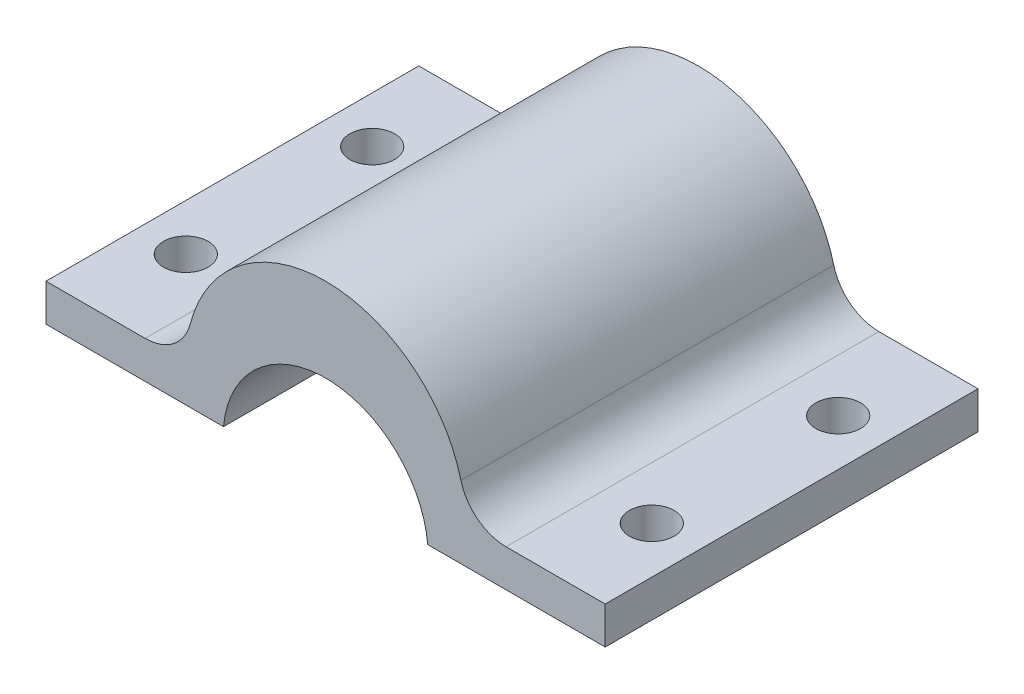
ISO-10303-21;
HEADER;
FILE_DESCRIPTION(('STEP AP214'),'2;1');
FILE_NAME('part.step','',(''),(''),'','','');
FILE_SCHEMA(('AUTOMOTIVE_DESIGN { 1 0 10303 214 1 1 1 1 }'));
ENDSEC;
DATA;
#1=APPLICATION_CONTEXT('core data for automotive mechanical design processes');
#2=APPLICATION_PROTOCOL_DEFINITION('international standard','automotive_design',2000,#1);
#3=PRODUCT_CONTEXT('',#1,'mechanical');
#4=PRODUCT('Part','Part','',(#3));
#5=PRODUCT_RELATED_PRODUCT_CATEGORY('part','',(#4));
#6=PRODUCT_DEFINITION_FORMATION('','',#4);
#7=PRODUCT_DEFINITION_CONTEXT('part definition',#1,'design');
#8=PRODUCT_DEFINITION('design','',#6,#7);
#9=PRODUCT_DEFINITION_SHAPE('','',#8);
#10=(LENGTH_UNIT() NAMED_UNIT(*) SI_UNIT(.MILLI.,.METRE.));
#11=(NAMED_UNIT(*) PLANE_ANGLE_UNIT() SI_UNIT($,.RADIAN.));
#12=(NAMED_UNIT(*) SI_UNIT($,.STERADIAN.) SOLID_ANGLE_UNIT());
#13=UNCERTAINTY_MEASURE_WITH_UNIT(LENGTH_MEASURE(1.E-05),#10,'distance_accuracy_value','');
#14=(GEOMETRIC_REPRESENTATION_CONTEXT(3) GLOBAL_UNCERTAINTY_ASSIGNED_CONTEXT((#13)) GLOBAL_UNIT_ASSIGNED_CONTEXT((#10,
#11,#12)) REPRESENTATION_CONTEXT('',''));
#15=CARTESIAN_POINT('',(0.,0.,0.));
#16=DIRECTION('',(0.,0.,1.));
#17=DIRECTION('',(1.,0.,0.));
#18=AXIS2_PLACEMENT_3D('',#15,#16,#17);
#19=CARTESIAN_POINT('',(30.,0.,40.));
#20=DIRECTION('',(0.,0.,-1.));
#21=DIRECTION('',(-1.,0.,0.));
#22=AXIS2_PLACEMENT_3D('',#19,#20,#21);
#23=CYLINDRICAL_SURFACE('',#22,11.);
#24=CARTESIAN_POINT('',(30.,0.,40.));
#25=DIRECTION('',(0.,0.,-1.));
#26=DIRECTION('',(-1.,0.,0.));
#27=AXIS2_PLACEMENT_3D('',#24,#25,#26);
#28=CIRCLE('',#27,11.);
#29=CARTESIAN_POINT('',(19.0455488498967,1.,40.));
#30=VERTEX_POINT('',#29);
#31=CARTESIAN_POINT('',(40.9544511501033,1.,40.));
#32=VERTEX_POINT('',#31);
#33=EDGE_CURVE('E172',#30,#32,#28,.T.);
#34=ORIENTED_EDGE('',*,*,#33,.F.);
#35=DIRECTION('',(0.,0.,-1.));
#36=VECTOR('',#35,1.);
#37=CARTESIAN_POINT('',(19.0455488498967,1.,40.));
#38=LINE('',#37,#36);
#39=CARTESIAN_POINT('',(19.0455488498967,1.,0.));
#40=VERTEX_POINT('',#39);
#41=EDGE_CURVE('E118',#40,#30,#38,.F.);
#42=ORIENTED_EDGE('',*,*,#41,.F.);
#43=CARTESIAN_POINT('',(30.,0.,0.));
#44=DIRECTION('',(0.,0.,-1.));
#45=DIRECTION('',(-1.,0.,0.));
#46=AXIS2_PLACEMENT_3D('',#43,#44,#45);
#47=CIRCLE('',#46,11.);
#48=CARTESIAN_POINT('',(40.9544511501033,0.999999999999999,0.));
#49=VERTEX_POINT('',#48);
#50=EDGE_CURVE('E152',#40,#49,#47,.T.);
#51=ORIENTED_EDGE('',*,*,#50,.T.);
#52=DIRECTION('',(0.,0.,-1.));
#53=VECTOR('',#52,1.);
#54=CARTESIAN_POINT('',(40.9544511501033,1.,40.));
#55=LINE('',#54,#53);
#56=EDGE_CURVE('E55',#32,#49,#55,.T.);
#57=ORIENTED_EDGE('',*,*,#56,.F.);
#58=EDGE_LOOP('',(#34,#42,#51,#57));
#59=FACE_BOUND('',#58,.T.);
#60=ADVANCED_FACE('F39',(#59),#23,.F.);
#61=CARTESIAN_POINT('',(60.,0.,40.));
#62=DIRECTION('',(-1.,0.,0.));
#63=DIRECTION('',(0.,0.,1.));
#64=AXIS2_PLACEMENT_3D('',#61,#62,#63);
#65=PLANE('',#64);
#66=DIRECTION('',(0.,1.,0.));
#67=VECTOR('',#66,1.);
#68=CARTESIAN_POINT('',(60.,0.,40.));
#69=LINE('',#68,#67);
#70=CARTESIAN_POINT('',(60.,1.,40.));
#71=VERTEX_POINT('',#70);
#72=CARTESIAN_POINT('',(60.,5.,40.));
#73=VERTEX_POINT('',#72);
#74=EDGE_CURVE('E221',#71,#73,#69,.T.);
#75=ORIENTED_EDGE('',*,*,#74,.F.);
#76=DIRECTION('',(0.,0.,-1.));
#77=VECTOR('',#76,1.);
#78=CARTESIAN_POINT('',(60.,1.,40.001));
#79=LINE('',#78,#77);
#80=CARTESIAN_POINT('',(60.,1.,0.));
#81=VERTEX_POINT('',#80);
#82=EDGE_CURVE('E248',#71,#81,#79,.T.);
#83=ORIENTED_EDGE('',*,*,#82,.T.);
#84=DIRECTION('',(0.,1.,0.));
#85=VECTOR('',#84,1.);
#86=CARTESIAN_POINT('',(60.,0.,0.));
#87=LINE('',#86,#85);
#88=CARTESIAN_POINT('',(60.,5.,0.));
#89=VERTEX_POINT('',#88);
#90=EDGE_CURVE('E156',#81,#89,#87,.T.);
#91=ORIENTED_EDGE('',*,*,#90,.T.);
#92=DIRECTION('',(0.,0.,-1.));
#93=VECTOR('',#92,1.);
#94=CARTESIAN_POINT('',(60.,5.,40.));
#95=LINE('',#94,#93);
#96=EDGE_CURVE('E146',#73,#89,#95,.T.);
#97=ORIENTED_EDGE('',*,*,#96,.F.);
#98=EDGE_LOOP('',(#75,#83,#91,#97));
#99=FACE_BOUND('',#98,.T.);
#100=ADVANCED_FACE('F298',(#99),#65,.F.);
#101=CARTESIAN_POINT('',(45.,5.,40.));
#102=DIRECTION('',(0.,-1.,0.));
#103=DIRECTION('',(0.,0.,-1.));
#104=AXIS2_PLACEMENT_3D('',#101,#102,#103);
#105=PLANE('',#104);
#106=CARTESIAN_POINT('',(55.,5.,30.));
#107=DIRECTION('',(0.,1.,0.));
#108=DIRECTION('',(0.,0.,1.));
#109=AXIS2_PLACEMENT_3D('',#106,#107,#108);
#110=CIRCLE('',#109,2.4);
#111=CARTESIAN_POINT('',(55.,5.,32.4));
#112=VERTEX_POINT('',#111);
#113=EDGE_CURVE('E236',#112,#112,#110,.T.);
#114=ORIENTED_EDGE('',*,*,#113,.F.);
#115=EDGE_LOOP('',(#114));
#116=FACE_BOUND('',#115,.T.);
#117=CARTESIAN_POINT('',(55.,5.,10.));
#118=DIRECTION('',(0.,1.,0.));
#119=DIRECTION('',(0.,0.,1.));
#120=AXIS2_PLACEMENT_3D('',#117,#118,#119);
#121=CIRCLE('',#120,2.4);
#122=CARTESIAN_POINT('',(55.,5.,12.4));
#123=VERTEX_POINT('',#122);
#124=EDGE_CURVE('E231',#123,#123,#121,.T.);
#125=ORIENTED_EDGE('',*,*,#124,.F.);
#126=EDGE_LOOP('',(#125));
#127=FACE_BOUND('',#126,.T.);
#128=DIRECTION('',(-1.,0.,0.));
#129=VECTOR('',#128,1.);
#130=CARTESIAN_POINT('',(45.,5.,0.));
#131=LINE('',#130,#129);
#132=CARTESIAN_POINT('',(49.3649167310371,5.,0.));
#133=VERTEX_POINT('',#132);
#134=EDGE_CURVE('E160',#89,#133,#131,.T.);
#135=ORIENTED_EDGE('',*,*,#134,.T.);
#136=DIRECTION('',(0.,0.,1.));
#137=VECTOR('',#136,1.);
#138=CARTESIAN_POINT('',(49.3649167310371,5.,40.));
#139=LINE('',#138,#137);
#140=CARTESIAN_POINT('',(49.3649167310371,5.,40.));
#141=VERTEX_POINT('',#140);
#142=EDGE_CURVE('E188',#133,#141,#139,.T.);
#143=ORIENTED_EDGE('',*,*,#142,.T.);
#144=DIRECTION('',(-1.,0.,0.));
#145=VECTOR('',#144,1.);
#146=CARTESIAN_POINT('',(45.,5.,40.));
#147=LINE('',#146,#145);
#148=EDGE_CURVE('E215',#73,#141,#147,.T.);
#149=ORIENTED_EDGE('',*,*,#148,.F.);
#150=ORIENTED_EDGE('',*,*,#96,.T.);
#151=EDGE_LOOP('',(#135,#143,#149,#150));
#152=FACE_BOUND('',#151,.T.);
#153=ADVANCED_FACE('F207',(#116,#127,#152),#105,.F.);
#154=CARTESIAN_POINT('',(30.,5.,40.));
#155=DIRECTION('',(0.,0.,-1.));
#156=DIRECTION('',(-1.,0.,0.));
#157=AXIS2_PLACEMENT_3D('',#154,#155,#156);
#158=CYLINDRICAL_SURFACE('',#157,15.);
#159=CARTESIAN_POINT('',(30.,5.,0.));
#160=DIRECTION('',(0.,0.,1.));
#161=DIRECTION('',(1.,0.,0.));
#162=AXIS2_PLACEMENT_3D('',#159,#160,#161);
#163=CIRCLE('',#162,15.);
#164=CARTESIAN_POINT('',(44.5236875482778,8.75,0.));
#165=VERTEX_POINT('',#164);
#166=CARTESIAN_POINT('',(15.4763124517222,8.75,0.));
#167=VERTEX_POINT('',#166);
#168=EDGE_CURVE('E164',#165,#167,#163,.T.);
#169=ORIENTED_EDGE('',*,*,#168,.T.);
#170=DIRECTION('',(0.,0.,-1.));
#171=VECTOR('',#170,1.);
#172=CARTESIAN_POINT('',(15.4763124517222,8.75,40.));
#173=LINE('',#172,#171);
#174=CARTESIAN_POINT('',(15.4763124517222,8.75,40.));
#175=VERTEX_POINT('',#174);
#176=EDGE_CURVE('E185',#167,#175,#173,.F.);
#177=ORIENTED_EDGE('',*,*,#176,.T.);
#178=CARTESIAN_POINT('',(30.,5.,40.));
#179=DIRECTION('',(0.,0.,1.));
#180=DIRECTION('',(1.,0.,0.));
#181=AXIS2_PLACEMENT_3D('',#178,#179,#180);
#182=CIRCLE('',#181,15.);
#183=CARTESIAN_POINT('',(44.5236875482778,8.75,40.));
#184=VERTEX_POINT('',#183);
#185=EDGE_CURVE('E148',#184,#175,#182,.T.);
#186=ORIENTED_EDGE('',*,*,#185,.F.);
#187=DIRECTION('',(0.,0.,-1.));
#188=VECTOR('',#187,1.);
#189=CARTESIAN_POINT('',(44.5236875482778,8.75,40.));
#190=LINE('',#189,#188);
#191=EDGE_CURVE('E181',#184,#165,#190,.T.);
#192=ORIENTED_EDGE('',*,*,#191,.T.);
#193=EDGE_LOOP('',(#169,#177,#186,#192));
#194=FACE_BOUND('',#193,.T.);
#195=ADVANCED_FACE('F217',(#194),#158,.T.);
#196=CARTESIAN_POINT('',(0.,5.,40.));
#197=DIRECTION('',(0.,-1.,0.));
#198=DIRECTION('',(0.,0.,-1.));
#199=AXIS2_PLACEMENT_3D('',#196,#197,#198);
#200=PLANE('',#199);
#201=CARTESIAN_POINT('',(5.,5.,30.));
#202=DIRECTION('',(0.,1.,0.));
#203=DIRECTION('',(0.,0.,1.));
#204=AXIS2_PLACEMENT_3D('',#201,#202,#203);
#205=CIRCLE('',#204,2.4);
#206=CARTESIAN_POINT('',(5.,5.,32.4));
#207=VERTEX_POINT('',#206);
#208=EDGE_CURVE('E232',#207,#207,#205,.T.);
#209=ORIENTED_EDGE('',*,*,#208,.F.);
#210=EDGE_LOOP('',(#209));
#211=FACE_BOUND('',#210,.T.);
#212=CARTESIAN_POINT('',(5.,5.,10.));
#213=DIRECTION('',(0.,1.,0.));
#214=DIRECTION('',(0.,0.,1.));
#215=AXIS2_PLACEMENT_3D('',#212,#213,#214);
#216=CIRCLE('',#215,2.4);
#217=CARTESIAN_POINT('',(5.,5.,12.4));
#218=VERTEX_POINT('',#217);
#219=EDGE_CURVE('E157',#218,#218,#216,.T.);
#220=ORIENTED_EDGE('',*,*,#219,.F.);
#221=EDGE_LOOP('',(#220));
#222=FACE_BOUND('',#221,.T.);
#223=DIRECTION('',(-1.,0.,0.));
#224=VECTOR('',#223,1.);
#225=CARTESIAN_POINT('',(0.,5.,40.));
#226=LINE('',#225,#224);
#227=CARTESIAN_POINT('',(10.6350832689629,5.,40.));
#228=VERTEX_POINT('',#227);
#229=CARTESIAN_POINT('',(0.,5.,40.));
#230=VERTEX_POINT('',#229);
#231=EDGE_CURVE('E139',#228,#230,#226,.T.);
#232=ORIENTED_EDGE('',*,*,#231,.F.);
#233=DIRECTION('',(0.,0.,1.));
#234=VECTOR('',#233,1.);
#235=CARTESIAN_POINT('',(10.6350832689629,5.,0.));
#236=LINE('',#235,#234);
#237=CARTESIAN_POINT('',(10.6350832689629,5.,0.));
#238=VERTEX_POINT('',#237);
#239=EDGE_CURVE('E177',#228,#238,#236,.F.);
#240=ORIENTED_EDGE('',*,*,#239,.T.);
#241=DIRECTION('',(-1.,0.,0.));
#242=VECTOR('',#241,1.);
#243=CARTESIAN_POINT('',(0.,5.,0.));
#244=LINE('',#243,#242);
#245=CARTESIAN_POINT('',(0.,5.,0.));
#246=VERTEX_POINT('',#245);
#247=EDGE_CURVE('E168',#238,#246,#244,.T.);
#248=ORIENTED_EDGE('',*,*,#247,.T.);
#249=DIRECTION('',(0.,0.,-1.));
#250=VECTOR('',#249,1.);
#251=CARTESIAN_POINT('',(0.,5.,40.));
#252=LINE('',#251,#250);
#253=EDGE_CURVE('E142',#230,#246,#252,.T.);
#254=ORIENTED_EDGE('',*,*,#253,.F.);
#255=EDGE_LOOP('',(#232,#240,#248,#254));
#256=FACE_BOUND('',#255,.T.);
#257=ADVANCED_FACE('F285',(#211,#222,#256),#200,.F.);
#258=CARTESIAN_POINT('',(0.,0.,40.));
#259=DIRECTION('',(1.,0.,0.));
#260=DIRECTION('',(0.,0.,-1.));
#261=AXIS2_PLACEMENT_3D('',#258,#259,#260);
#262=PLANE('',#261);
#263=DIRECTION('',(0.,-1.,0.));
#264=VECTOR('',#263,1.);
#265=CARTESIAN_POINT('',(0.,0.,0.));
#266=LINE('',#265,#264);
#267=CARTESIAN_POINT('',(0.,1.,0.));
#268=VERTEX_POINT('',#267);
#269=EDGE_CURVE('E133',#246,#268,#266,.T.);
#270=ORIENTED_EDGE('',*,*,#269,.T.);
#271=DIRECTION('',(0.,0.,-1.));
#272=VECTOR('',#271,1.);
#273=CARTESIAN_POINT('',(0.,1.,40.001));
#274=LINE('',#273,#272);
#275=CARTESIAN_POINT('',(0.,1.,40.));
#276=VERTEX_POINT('',#275);
#277=EDGE_CURVE('E63',#276,#268,#274,.T.);
#278=ORIENTED_EDGE('',*,*,#277,.F.);
#279=DIRECTION('',(0.,-1.,0.));
#280=VECTOR('',#279,1.);
#281=CARTESIAN_POINT('',(0.,0.,40.));
#282=LINE('',#281,#280);
#283=EDGE_CURVE('E131',#230,#276,#282,.T.);
#284=ORIENTED_EDGE('',*,*,#283,.F.);
#285=ORIENTED_EDGE('',*,*,#253,.T.);
#286=EDGE_LOOP('',(#270,#278,#284,#285));
#287=FACE_BOUND('',#286,.T.);
#288=ADVANCED_FACE('F129',(#287),#262,.F.);
#289=CARTESIAN_POINT('',(30.,5.,40.));
#290=DIRECTION('',(0.,0.,1.));
#291=DIRECTION('',(1.,0.,0.));
#292=AXIS2_PLACEMENT_3D('',#289,#290,#291);
#293=PLANE('',#292);
#294=DIRECTION('',(1.,0.,0.));
#295=VECTOR('',#294,1.);
#296=CARTESIAN_POINT('',(60.,1.,40.));
#297=LINE('',#296,#295);
#298=EDGE_CURVE('E114',#276,#30,#297,.T.);
#299=ORIENTED_EDGE('',*,*,#298,.T.);
#300=ORIENTED_EDGE('',*,*,#33,.T.);
#301=DIRECTION('',(1.,0.,0.));
#302=VECTOR('',#301,1.);
#303=CARTESIAN_POINT('',(60.,1.,40.));
#304=LINE('',#303,#302);
#305=EDGE_CURVE('E244',#32,#71,#304,.T.);
#306=ORIENTED_EDGE('',*,*,#305,.T.);
#307=ORIENTED_EDGE('',*,*,#74,.T.);
#308=ORIENTED_EDGE('',*,*,#148,.T.);
#309=CARTESIAN_POINT('',(49.3649167310371,10.,40.));
#310=DIRECTION('',(0.,0.,1.));
#311=DIRECTION('',(1.,0.,0.));
#312=AXIS2_PLACEMENT_3D('',#309,#310,#311);
#313=CIRCLE('',#312,5.);
#314=EDGE_CURVE('E11',#141,#184,#313,.F.);
#315=ORIENTED_EDGE('',*,*,#314,.T.);
#316=ORIENTED_EDGE('',*,*,#185,.T.);
#317=CARTESIAN_POINT('',(10.6350832689629,10.,40.));
#318=DIRECTION('',(0.,0.,1.));
#319=DIRECTION('',(1.,0.,0.));
#320=AXIS2_PLACEMENT_3D('',#317,#318,#319);
#321=CIRCLE('',#320,5.);
#322=EDGE_CURVE('E194',#175,#228,#321,.F.);
#323=ORIENTED_EDGE('',*,*,#322,.T.);
#324=ORIENTED_EDGE('',*,*,#231,.T.);
#325=ORIENTED_EDGE('',*,*,#283,.T.);
#326=EDGE_LOOP('',(#299,#300,#306,#307,#308,#315,#316,#323,#324,#325));
#327=FACE_BOUND('',#326,.T.);
#328=ADVANCED_FACE('F137',(#327),#293,.T.);
#329=CARTESIAN_POINT('',(30.,5.,0.));
#330=DIRECTION('',(0.,0.,1.));
#331=DIRECTION('',(1.,0.,0.));
#332=AXIS2_PLACEMENT_3D('',#329,#330,#331);
#333=PLANE('',#332);
#334=ORIENTED_EDGE('',*,*,#50,.F.);
#335=DIRECTION('',(1.,0.,0.));
#336=VECTOR('',#335,1.);
#337=CARTESIAN_POINT('',(60.,1.,0.));
#338=LINE('',#337,#336);
#339=EDGE_CURVE('E124',#268,#40,#338,.T.);
#340=ORIENTED_EDGE('',*,*,#339,.F.);
#341=ORIENTED_EDGE('',*,*,#269,.F.);
#342=ORIENTED_EDGE('',*,*,#247,.F.);
#343=CARTESIAN_POINT('',(10.6350832689629,10.,0.));
#344=DIRECTION('',(0.,0.,1.));
#345=DIRECTION('',(1.,0.,0.));
#346=AXIS2_PLACEMENT_3D('',#343,#344,#345);
#347=CIRCLE('',#346,5.);
#348=EDGE_CURVE('E191',#238,#167,#347,.T.);
#349=ORIENTED_EDGE('',*,*,#348,.T.);
#350=ORIENTED_EDGE('',*,*,#168,.F.);
#351=CARTESIAN_POINT('',(49.3649167310371,10.,0.));
#352=DIRECTION('',(0.,0.,1.));
#353=DIRECTION('',(1.,0.,0.));
#354=AXIS2_PLACEMENT_3D('',#351,#352,#353);
#355=CIRCLE('',#354,5.);
#356=EDGE_CURVE('E48',#165,#133,#355,.T.);
#357=ORIENTED_EDGE('',*,*,#356,.T.);
#358=ORIENTED_EDGE('',*,*,#134,.F.);
#359=ORIENTED_EDGE('',*,*,#90,.F.);
#360=DIRECTION('',(1.,0.,0.));
#361=VECTOR('',#360,1.);
#362=CARTESIAN_POINT('',(60.,1.,0.));
#363=LINE('',#362,#361);
#364=EDGE_CURVE('E249',#49,#81,#363,.T.);
#365=ORIENTED_EDGE('',*,*,#364,.F.);
#366=EDGE_LOOP('',(#334,#340,#341,#342,#349,#350,#357,#358,#359,#365));
#367=FACE_BOUND('',#366,.T.);
#368=ADVANCED_FACE('F201',(#367),#333,.F.);
#369=CARTESIAN_POINT('',(5.,0.,10.));
#370=DIRECTION('',(0.,1.,0.));
#371=DIRECTION('',(0.,0.,1.));
#372=AXIS2_PLACEMENT_3D('',#369,#370,#371);
#373=CYLINDRICAL_SURFACE('',#372,2.4);
#374=CARTESIAN_POINT('',(5.,1.,10.));
#375=DIRECTION('',(0.,1.,0.));
#376=DIRECTION('',(0.,0.,1.));
#377=AXIS2_PLACEMENT_3D('',#374,#375,#376);
#378=CIRCLE('',#377,2.4);
#379=CARTESIAN_POINT('',(5.,1.,12.4));
#380=VERTEX_POINT('',#379);
#381=EDGE_CURVE('E237',#380,#380,#378,.T.);
#382=ORIENTED_EDGE('',*,*,#381,.F.);
#383=EDGE_LOOP('',(#382));
#384=FACE_BOUND('',#383,.T.);
#385=ORIENTED_EDGE('',*,*,#219,.T.);
#386=EDGE_LOOP('',(#385));
#387=FACE_BOUND('',#386,.T.);
#388=ADVANCED_FACE('F281',(#384,#387),#373,.F.);
#389=CARTESIAN_POINT('',(5.,0.,30.));
#390=DIRECTION('',(0.,1.,0.));
#391=DIRECTION('',(0.,0.,1.));
#392=AXIS2_PLACEMENT_3D('',#389,#390,#391);
#393=CYLINDRICAL_SURFACE('',#392,2.4);
#394=CARTESIAN_POINT('',(5.,1.,30.));
#395=DIRECTION('',(0.,1.,0.));
#396=DIRECTION('',(0.,0.,1.));
#397=AXIS2_PLACEMENT_3D('',#394,#395,#396);
#398=CIRCLE('',#397,2.4);
#399=CARTESIAN_POINT('',(5.,1.,32.4));
#400=VERTEX_POINT('',#399);
#401=EDGE_CURVE('E135',#400,#400,#398,.T.);
#402=ORIENTED_EDGE('',*,*,#401,.F.);
#403=EDGE_LOOP('',(#402));
#404=FACE_BOUND('',#403,.T.);
#405=ORIENTED_EDGE('',*,*,#208,.T.);
#406=EDGE_LOOP('',(#405));
#407=FACE_BOUND('',#406,.T.);
#408=ADVANCED_FACE('F277',(#404,#407),#393,.F.);
#409=CARTESIAN_POINT('',(55.,0.,10.));
#410=DIRECTION('',(0.,1.,0.));
#411=DIRECTION('',(0.,0.,1.));
#412=AXIS2_PLACEMENT_3D('',#409,#410,#411);
#413=CYLINDRICAL_SURFACE('',#412,2.4);
#414=CARTESIAN_POINT('',(55.,1.,10.));
#415=DIRECTION('',(0.,1.,0.));
#416=DIRECTION('',(0.,0.,1.));
#417=AXIS2_PLACEMENT_3D('',#414,#415,#416);
#418=CIRCLE('',#417,2.4);
#419=CARTESIAN_POINT('',(55.,1.,12.4));
#420=VERTEX_POINT('',#419);
#421=EDGE_CURVE('E258',#420,#420,#418,.T.);
#422=ORIENTED_EDGE('',*,*,#421,.F.);
#423=EDGE_LOOP('',(#422));
#424=FACE_BOUND('',#423,.T.);
#425=ORIENTED_EDGE('',*,*,#124,.T.);
#426=EDGE_LOOP('',(#425));
#427=FACE_BOUND('',#426,.T.);
#428=ADVANCED_FACE('F280',(#424,#427),#413,.F.);
#429=CARTESIAN_POINT('',(55.,0.,30.));
#430=DIRECTION('',(0.,1.,0.));
#431=DIRECTION('',(0.,0.,1.));
#432=AXIS2_PLACEMENT_3D('',#429,#430,#431);
#433=CYLINDRICAL_SURFACE('',#432,2.4);
#434=CARTESIAN_POINT('',(55.,1.,30.));
#435=DIRECTION('',(0.,1.,0.));
#436=DIRECTION('',(0.,0.,1.));
#437=AXIS2_PLACEMENT_3D('',#434,#435,#436);
#438=CIRCLE('',#437,2.4);
#439=CARTESIAN_POINT('',(55.,1.,32.4));
#440=VERTEX_POINT('',#439);
#441=EDGE_CURVE('E254',#440,#440,#438,.T.);
#442=ORIENTED_EDGE('',*,*,#441,.F.);
#443=EDGE_LOOP('',(#442));
#444=FACE_BOUND('',#443,.T.);
#445=ORIENTED_EDGE('',*,*,#113,.T.);
#446=EDGE_LOOP('',(#445));
#447=FACE_BOUND('',#446,.T.);
#448=ADVANCED_FACE('F307',(#444,#447),#433,.F.);
#449=CARTESIAN_POINT('',(10.6350832689629,10.,40.));
#450=DIRECTION('',(0.,0.,-1.));
#451=DIRECTION('',(-1.,0.,0.));
#452=AXIS2_PLACEMENT_3D('',#449,#450,#451);
#453=CYLINDRICAL_SURFACE('',#452,5.);
#454=ORIENTED_EDGE('',*,*,#322,.F.);
#455=ORIENTED_EDGE('',*,*,#176,.F.);
#456=ORIENTED_EDGE('',*,*,#348,.F.);
#457=ORIENTED_EDGE('',*,*,#239,.F.);
#458=EDGE_LOOP('',(#454,#455,#456,#457));
#459=FACE_BOUND('',#458,.T.);
#460=ADVANCED_FACE('F294',(#459),#453,.F.);
#461=CARTESIAN_POINT('',(49.3649167310371,10.,40.));
#462=DIRECTION('',(0.,0.,-1.));
#463=DIRECTION('',(-1.,0.,0.));
#464=AXIS2_PLACEMENT_3D('',#461,#462,#463);
#465=CYLINDRICAL_SURFACE('',#464,5.);
#466=ORIENTED_EDGE('',*,*,#314,.F.);
#467=ORIENTED_EDGE('',*,*,#142,.F.);
#468=ORIENTED_EDGE('',*,*,#356,.F.);
#469=ORIENTED_EDGE('',*,*,#191,.F.);
#470=EDGE_LOOP('',(#466,#467,#468,#469));
#471=FACE_BOUND('',#470,.T.);
#472=ADVANCED_FACE('F41',(#471),#465,.F.);
#473=CARTESIAN_POINT('',(60.,1.,40.001));
#474=DIRECTION('',(0.,1.,0.));
#475=DIRECTION('',(0.,0.,1.));
#476=AXIS2_PLACEMENT_3D('',#473,#474,#475);
#477=PLANE('',#476);
#478=ORIENTED_EDGE('',*,*,#56,.T.);
#479=ORIENTED_EDGE('',*,*,#364,.T.);
#480=ORIENTED_EDGE('',*,*,#82,.F.);
#481=ORIENTED_EDGE('',*,*,#305,.F.);
#482=EDGE_LOOP('',(#478,#479,#480,#481));
#483=FACE_BOUND('',#482,.T.);
#484=ORIENTED_EDGE('',*,*,#421,.T.);
#485=EDGE_LOOP('',(#484));
#486=FACE_BOUND('',#485,.T.);
#487=ORIENTED_EDGE('',*,*,#441,.T.);
#488=EDGE_LOOP('',(#487));
#489=FACE_BOUND('',#488,.T.);
#490=ADVANCED_FACE('F299',(#483,#486,#489),#477,.F.);
#491=CARTESIAN_POINT('',(60.,1.,40.001));
#492=DIRECTION('',(0.,1.,0.));
#493=DIRECTION('',(0.,0.,1.));
#494=AXIS2_PLACEMENT_3D('',#491,#492,#493);
#495=PLANE('',#494);
#496=ORIENTED_EDGE('',*,*,#41,.T.);
#497=ORIENTED_EDGE('',*,*,#298,.F.);
#498=ORIENTED_EDGE('',*,*,#277,.T.);
#499=ORIENTED_EDGE('',*,*,#339,.T.);
#500=EDGE_LOOP('',(#496,#497,#498,#499));
#501=FACE_BOUND('',#500,.T.);
#502=ORIENTED_EDGE('',*,*,#401,.T.);
#503=EDGE_LOOP('',(#502));
#504=FACE_BOUND('',#503,.T.);
#505=ORIENTED_EDGE('',*,*,#381,.T.);
#506=EDGE_LOOP('',(#505));
#507=FACE_BOUND('',#506,.T.);
#508=ADVANCED_FACE('F115',(#501,#504,#507),#495,.F.);
#509=CLOSED_SHELL('',(#60,#100,#153,#195,#257,#288,#328,#368,#388,#408,#428,#448,#460,#472,#490,#508));
#510=MANIFOLD_SOLID_BREP('B2',#509);
#511=ADVANCED_BREP_SHAPE_REPRESENTATION('',(#18,#510),#14);
#512=SHAPE_DEFINITION_REPRESENTATION(#9,#511);
ENDSEC;
END-ISO-10303-21;
